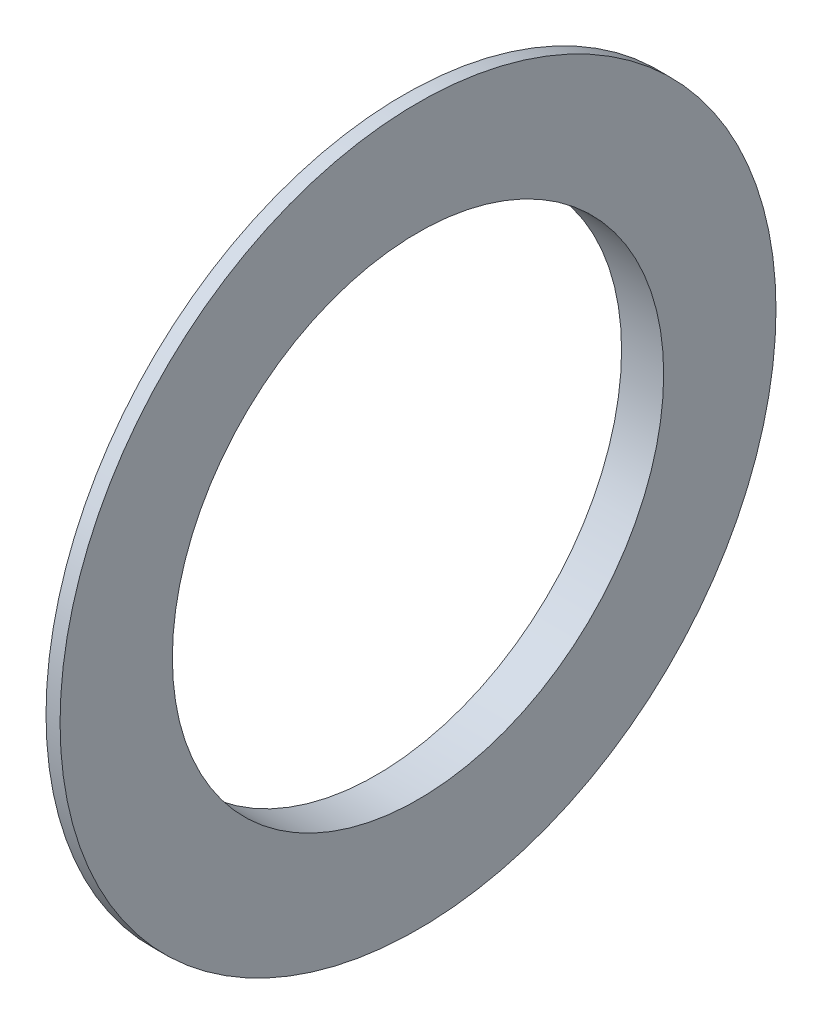
ISO-10303-21;
HEADER;
FILE_DESCRIPTION(('STEP AP214'),'2;1');
FILE_NAME('part.step','',(''),(''),'','','');
FILE_SCHEMA(('AUTOMOTIVE_DESIGN { 1 0 10303 214 1 1 1 1 }'));
ENDSEC;
DATA;
#1=APPLICATION_CONTEXT('core data for automotive mechanical design processes');
#2=APPLICATION_PROTOCOL_DEFINITION('international standard','automotive_design',2000,#1);
#3=PRODUCT_CONTEXT('',#1,'mechanical');
#4=PRODUCT('Part','Part','',(#3));
#5=PRODUCT_RELATED_PRODUCT_CATEGORY('part','',(#4));
#6=PRODUCT_DEFINITION_FORMATION('','',#4);
#7=PRODUCT_DEFINITION_CONTEXT('part definition',#1,'design');
#8=PRODUCT_DEFINITION('design','',#6,#7);
#9=PRODUCT_DEFINITION_SHAPE('','',#8);
#10=(LENGTH_UNIT() NAMED_UNIT(*) SI_UNIT(.MILLI.,.METRE.));
#11=(NAMED_UNIT(*) PLANE_ANGLE_UNIT() SI_UNIT($,.RADIAN.));
#12=(NAMED_UNIT(*) SI_UNIT($,.STERADIAN.) SOLID_ANGLE_UNIT());
#13=UNCERTAINTY_MEASURE_WITH_UNIT(LENGTH_MEASURE(1.E-05),#10,'distance_accuracy_value','');
#14=(GEOMETRIC_REPRESENTATION_CONTEXT(3) GLOBAL_UNCERTAINTY_ASSIGNED_CONTEXT((#13)) GLOBAL_UNIT_ASSIGNED_CONTEXT((#10,
#11,#12)) REPRESENTATION_CONTEXT('',''));
#15=CARTESIAN_POINT('',(0.,0.,0.));
#16=DIRECTION('',(0.,0.,1.));
#17=DIRECTION('',(1.,0.,0.));
#18=AXIS2_PLACEMENT_3D('',#15,#16,#17);
#19=CARTESIAN_POINT('',(88.7511627906977,0.,0.));
#20=DIRECTION('',(1.,0.,0.));
#21=DIRECTION('',(0.,0.,-1.));
#22=AXIS2_PLACEMENT_3D('',#19,#20,#21);
#23=CONICAL_SURFACE('',#22,25.5,1.26952072642242);
#24=CARTESIAN_POINT('',(86.7511627906977,0.,0.));
#25=DIRECTION('',(-1.,0.,0.));
#26=DIRECTION('',(0.,0.,1.));
#27=AXIS2_PLACEMENT_3D('',#24,#25,#26);
#28=CIRCLE('',#27,19.0636363636363);
#29=CARTESIAN_POINT('',(86.7511627906977,0.,19.0636363636363));
#30=VERTEX_POINT('',#29);
#31=EDGE_CURVE('E10',#30,#30,#28,.T.);
#32=ORIENTED_EDGE('',*,*,#31,.F.);
#33=EDGE_LOOP('',(#32));
#34=FACE_BOUND('',#33,.T.);
#35=CARTESIAN_POINT('',(88.7511627906977,0.,0.));
#36=DIRECTION('',(-1.,0.,0.));
#37=DIRECTION('',(0.,0.,1.));
#38=AXIS2_PLACEMENT_3D('',#35,#36,#37);
#39=CIRCLE('',#38,25.5);
#40=CARTESIAN_POINT('',(88.7511627906977,0.,25.5));
#41=VERTEX_POINT('',#40);
#42=EDGE_CURVE('E49',#41,#41,#39,.T.);
#43=ORIENTED_EDGE('',*,*,#42,.T.);
#44=EDGE_LOOP('',(#43));
#45=FACE_BOUND('',#44,.T.);
#46=ADVANCED_FACE('F30',(#34,#45),#23,.T.);
#47=CARTESIAN_POINT('',(86.7511627906977,19.0636363636363,0.));
#48=DIRECTION('',(1.,0.,0.));
#49=DIRECTION('',(0.,0.,-1.));
#50=AXIS2_PLACEMENT_3D('',#47,#48,#49);
#51=PLANE('',#50);
#52=CARTESIAN_POINT('',(86.7511627906977,0.,0.));
#53=DIRECTION('',(-1.,0.,0.));
#54=DIRECTION('',(0.,0.,1.));
#55=AXIS2_PLACEMENT_3D('',#52,#53,#54);
#56=CIRCLE('',#55,17.5);
#57=CARTESIAN_POINT('',(86.7511627906977,0.,17.5));
#58=VERTEX_POINT('',#57);
#59=EDGE_CURVE('E36',#58,#58,#56,.T.);
#60=ORIENTED_EDGE('',*,*,#59,.F.);
#61=EDGE_LOOP('',(#60));
#62=FACE_BOUND('',#61,.T.);
#63=ORIENTED_EDGE('',*,*,#31,.T.);
#64=EDGE_LOOP('',(#63));
#65=FACE_BOUND('',#64,.T.);
#66=ADVANCED_FACE('F68',(#62,#65),#51,.F.);
#67=CARTESIAN_POINT('',(0.,0.,0.));
#68=DIRECTION('',(-1.,0.,0.));
#69=DIRECTION('',(0.,0.,1.));
#70=AXIS2_PLACEMENT_3D('',#67,#68,#69);
#71=CYLINDRICAL_SURFACE('',#70,17.5);
#72=CARTESIAN_POINT('',(89.7511627906977,0.,0.));
#73=DIRECTION('',(-1.,0.,0.));
#74=DIRECTION('',(0.,0.,1.));
#75=AXIS2_PLACEMENT_3D('',#72,#73,#74);
#76=CIRCLE('',#75,17.5);
#77=CARTESIAN_POINT('',(89.7511627906977,0.,17.5));
#78=VERTEX_POINT('',#77);
#79=EDGE_CURVE('E40',#78,#78,#76,.T.);
#80=ORIENTED_EDGE('',*,*,#79,.F.);
#81=EDGE_LOOP('',(#80));
#82=FACE_BOUND('',#81,.T.);
#83=ORIENTED_EDGE('',*,*,#59,.T.);
#84=EDGE_LOOP('',(#83));
#85=FACE_BOUND('',#84,.T.);
#86=ADVANCED_FACE('F63',(#82,#85),#71,.F.);
#87=CARTESIAN_POINT('',(89.7511627906977,17.5,0.));
#88=DIRECTION('',(-1.,0.,0.));
#89=DIRECTION('',(0.,0.,1.));
#90=AXIS2_PLACEMENT_3D('',#87,#88,#89);
#91=PLANE('',#90);
#92=CARTESIAN_POINT('',(89.7511627906977,0.,0.));
#93=DIRECTION('',(-1.,0.,0.));
#94=DIRECTION('',(0.,0.,1.));
#95=AXIS2_PLACEMENT_3D('',#92,#93,#94);
#96=CIRCLE('',#95,25.5);
#97=CARTESIAN_POINT('',(89.7511627906977,0.,25.5));
#98=VERTEX_POINT('',#97);
#99=EDGE_CURVE('E44',#98,#98,#96,.T.);
#100=ORIENTED_EDGE('',*,*,#99,.F.);
#101=EDGE_LOOP('',(#100));
#102=FACE_BOUND('',#101,.T.);
#103=ORIENTED_EDGE('',*,*,#79,.T.);
#104=EDGE_LOOP('',(#103));
#105=FACE_BOUND('',#104,.T.);
#106=ADVANCED_FACE('F57',(#102,#105),#91,.F.);
#107=CARTESIAN_POINT('',(0.,0.,0.));
#108=DIRECTION('',(-1.,0.,0.));
#109=DIRECTION('',(0.,0.,1.));
#110=AXIS2_PLACEMENT_3D('',#107,#108,#109);
#111=CYLINDRICAL_SURFACE('',#110,25.5);
#112=ORIENTED_EDGE('',*,*,#42,.F.);
#113=EDGE_LOOP('',(#112));
#114=FACE_BOUND('',#113,.T.);
#115=ORIENTED_EDGE('',*,*,#99,.T.);
#116=EDGE_LOOP('',(#115));
#117=FACE_BOUND('',#116,.T.);
#118=ADVANCED_FACE('F54',(#114,#117),#111,.T.);
#119=CLOSED_SHELL('',(#46,#66,#86,#106,#118));
#120=MANIFOLD_SOLID_BREP('B2',#119);
#121=ADVANCED_BREP_SHAPE_REPRESENTATION('',(#18,#120),#14);
#122=SHAPE_DEFINITION_REPRESENTATION(#9,#121);
ENDSEC;
END-ISO-10303-21;
